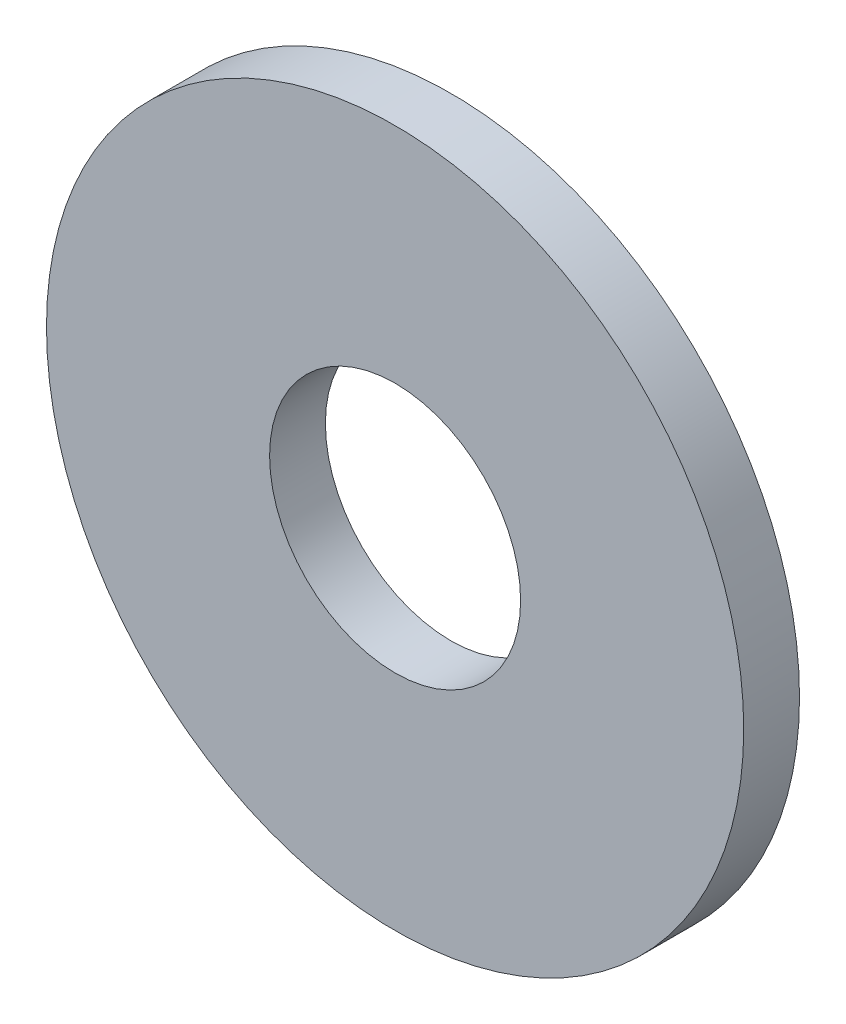
ISO-10303-21;
HEADER;
FILE_DESCRIPTION(('STEP AP214'),'2;1');
FILE_NAME('part.step','',(''),(''),'','','');
FILE_SCHEMA(('AUTOMOTIVE_DESIGN { 1 0 10303 214 1 1 1 1 }'));
ENDSEC;
DATA;
#1=APPLICATION_CONTEXT('core data for automotive mechanical design processes');
#2=APPLICATION_PROTOCOL_DEFINITION('international standard','automotive_design',2000,#1);
#3=PRODUCT_CONTEXT('',#1,'mechanical');
#4=PRODUCT('Part','Part','',(#3));
#5=PRODUCT_RELATED_PRODUCT_CATEGORY('part','',(#4));
#6=PRODUCT_DEFINITION_FORMATION('','',#4);
#7=PRODUCT_DEFINITION_CONTEXT('part definition',#1,'design');
#8=PRODUCT_DEFINITION('design','',#6,#7);
#9=PRODUCT_DEFINITION_SHAPE('','',#8);
#10=(LENGTH_UNIT() NAMED_UNIT(*) SI_UNIT(.MILLI.,.METRE.));
#11=(NAMED_UNIT(*) PLANE_ANGLE_UNIT() SI_UNIT($,.RADIAN.));
#12=(NAMED_UNIT(*) SI_UNIT($,.STERADIAN.) SOLID_ANGLE_UNIT());
#13=UNCERTAINTY_MEASURE_WITH_UNIT(LENGTH_MEASURE(1.E-05),#10,'distance_accuracy_value','');
#14=(GEOMETRIC_REPRESENTATION_CONTEXT(3) GLOBAL_UNCERTAINTY_ASSIGNED_CONTEXT((#13)) GLOBAL_UNIT_ASSIGNED_CONTEXT((#10,
#11,#12)) REPRESENTATION_CONTEXT('',''));
#15=CARTESIAN_POINT('',(0.,0.,0.));
#16=DIRECTION('',(0.,0.,1.));
#17=DIRECTION('',(1.,0.,0.));
#18=AXIS2_PLACEMENT_3D('',#15,#16,#17);
#19=CARTESIAN_POINT('',(0.,0.,0.8));
#20=DIRECTION('',(0.,0.,1.));
#21=DIRECTION('',(1.,0.,0.));
#22=AXIS2_PLACEMENT_3D('',#19,#20,#21);
#23=PLANE('',#22);
#24=CARTESIAN_POINT('',(0.,0.,0.8));
#25=DIRECTION('',(0.,0.,1.));
#26=DIRECTION('',(1.,0.,0.));
#27=AXIS2_PLACEMENT_3D('',#24,#25,#26);
#28=CIRCLE('',#27,5.);
#29=CARTESIAN_POINT('',(5.,0.,0.8));
#30=VERTEX_POINT('',#29);
#31=EDGE_CURVE('E10',#30,#30,#28,.T.);
#32=ORIENTED_EDGE('',*,*,#31,.T.);
#33=EDGE_LOOP('',(#32));
#34=FACE_BOUND('',#33,.T.);
#35=CARTESIAN_POINT('',(0.,0.,0.8));
#36=DIRECTION('',(0.,0.,1.));
#37=DIRECTION('',(1.,0.,0.));
#38=AXIS2_PLACEMENT_3D('',#35,#36,#37);
#39=CIRCLE('',#38,1.8);
#40=CARTESIAN_POINT('',(1.8,0.,0.8));
#41=VERTEX_POINT('',#40);
#42=EDGE_CURVE('E44',#41,#41,#39,.T.);
#43=ORIENTED_EDGE('',*,*,#42,.F.);
#44=EDGE_LOOP('',(#43));
#45=FACE_BOUND('',#44,.T.);
#46=ADVANCED_FACE('F33',(#34,#45),#23,.T.);
#47=CARTESIAN_POINT('',(0.,0.,0.));
#48=DIRECTION('',(0.,0.,1.));
#49=DIRECTION('',(1.,0.,0.));
#50=AXIS2_PLACEMENT_3D('',#47,#48,#49);
#51=PLANE('',#50);
#52=CARTESIAN_POINT('',(0.,0.,0.));
#53=DIRECTION('',(0.,0.,1.));
#54=DIRECTION('',(1.,0.,0.));
#55=AXIS2_PLACEMENT_3D('',#52,#53,#54);
#56=CIRCLE('',#55,5.);
#57=CARTESIAN_POINT('',(5.,0.,0.));
#58=VERTEX_POINT('',#57);
#59=EDGE_CURVE('E37',#58,#58,#56,.T.);
#60=ORIENTED_EDGE('',*,*,#59,.F.);
#61=EDGE_LOOP('',(#60));
#62=FACE_BOUND('',#61,.T.);
#63=CARTESIAN_POINT('',(0.,0.,0.));
#64=DIRECTION('',(0.,0.,1.));
#65=DIRECTION('',(1.,0.,0.));
#66=AXIS2_PLACEMENT_3D('',#63,#64,#65);
#67=CIRCLE('',#66,1.8);
#68=CARTESIAN_POINT('',(1.8,0.,0.));
#69=VERTEX_POINT('',#68);
#70=EDGE_CURVE('E46',#69,#69,#67,.T.);
#71=ORIENTED_EDGE('',*,*,#70,.T.);
#72=EDGE_LOOP('',(#71));
#73=FACE_BOUND('',#72,.T.);
#74=ADVANCED_FACE('F56',(#62,#73),#51,.F.);
#75=CARTESIAN_POINT('',(0.,0.,0.8));
#76=DIRECTION('',(0.,0.,-1.));
#77=DIRECTION('',(-1.,0.,0.));
#78=AXIS2_PLACEMENT_3D('',#75,#76,#77);
#79=CYLINDRICAL_SURFACE('',#78,5.);
#80=ORIENTED_EDGE('',*,*,#31,.F.);
#81=EDGE_LOOP('',(#80));
#82=FACE_BOUND('',#81,.T.);
#83=ORIENTED_EDGE('',*,*,#59,.T.);
#84=EDGE_LOOP('',(#83));
#85=FACE_BOUND('',#84,.T.);
#86=ADVANCED_FACE('F35',(#82,#85),#79,.T.);
#87=CARTESIAN_POINT('',(0.,0.,0.8));
#88=DIRECTION('',(0.,0.,-1.));
#89=DIRECTION('',(-1.,0.,0.));
#90=AXIS2_PLACEMENT_3D('',#87,#88,#89);
#91=CYLINDRICAL_SURFACE('',#90,1.8);
#92=ORIENTED_EDGE('',*,*,#42,.T.);
#93=EDGE_LOOP('',(#92));
#94=FACE_BOUND('',#93,.T.);
#95=ORIENTED_EDGE('',*,*,#70,.F.);
#96=EDGE_LOOP('',(#95));
#97=FACE_BOUND('',#96,.T.);
#98=ADVANCED_FACE('F52',(#94,#97),#91,.F.);
#99=CLOSED_SHELL('',(#46,#74,#86,#98));
#100=MANIFOLD_SOLID_BREP('B2',#99);
#101=ADVANCED_BREP_SHAPE_REPRESENTATION('',(#18,#100),#14);
#102=SHAPE_DEFINITION_REPRESENTATION(#9,#101);
ENDSEC;
END-ISO-10303-21;
